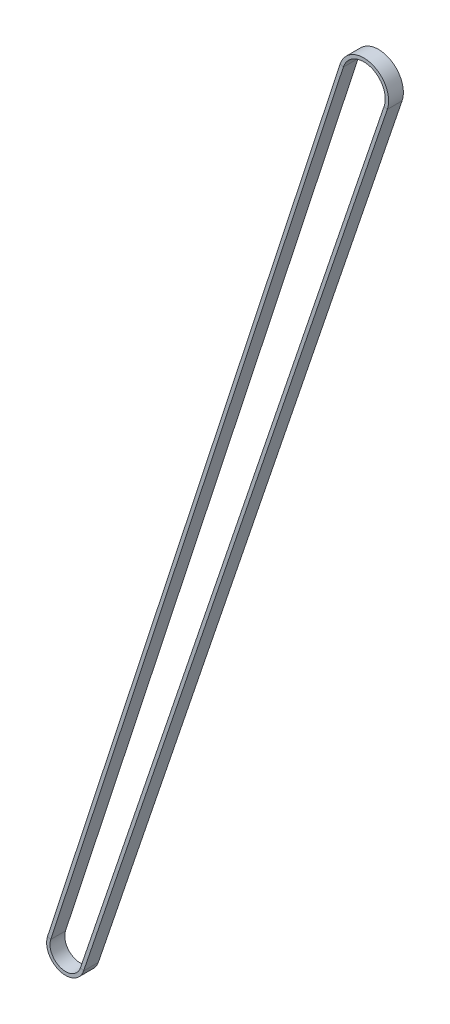
ISO-10303-21;
HEADER;
FILE_DESCRIPTION(('STEP AP214'),'2;1');
FILE_NAME('part.step','',(''),(''),'','','');
FILE_SCHEMA(('AUTOMOTIVE_DESIGN { 1 0 10303 214 1 1 1 1 }'));
ENDSEC;
DATA;
#1=APPLICATION_CONTEXT('core data for automotive mechanical design processes');
#2=APPLICATION_PROTOCOL_DEFINITION('international standard','automotive_design',2000,#1);
#3=PRODUCT_CONTEXT('',#1,'mechanical');
#4=PRODUCT('Part','Part','',(#3));
#5=PRODUCT_RELATED_PRODUCT_CATEGORY('part','',(#4));
#6=PRODUCT_DEFINITION_FORMATION('','',#4);
#7=PRODUCT_DEFINITION_CONTEXT('part definition',#1,'design');
#8=PRODUCT_DEFINITION('design','',#6,#7);
#9=PRODUCT_DEFINITION_SHAPE('','',#8);
#10=(LENGTH_UNIT() NAMED_UNIT(*) SI_UNIT(.MILLI.,.METRE.));
#11=(NAMED_UNIT(*) PLANE_ANGLE_UNIT() SI_UNIT($,.RADIAN.));
#12=(NAMED_UNIT(*) SI_UNIT($,.STERADIAN.) SOLID_ANGLE_UNIT());
#13=UNCERTAINTY_MEASURE_WITH_UNIT(LENGTH_MEASURE(1.E-05),#10,'distance_accuracy_value','');
#14=(GEOMETRIC_REPRESENTATION_CONTEXT(3) GLOBAL_UNCERTAINTY_ASSIGNED_CONTEXT((#13)) GLOBAL_UNIT_ASSIGNED_CONTEXT((#10,
#11,#12)) REPRESENTATION_CONTEXT('',''));
#15=CARTESIAN_POINT('',(0.,0.,0.));
#16=DIRECTION('',(0.,0.,1.));
#17=DIRECTION('',(1.,0.,0.));
#18=AXIS2_PLACEMENT_3D('',#15,#16,#17);
#19=CARTESIAN_POINT('',(121.383508925204,366.363412522024,0.));
#20=DIRECTION('',(0.,0.,1.));
#21=DIRECTION('',(1.,0.,0.));
#22=AXIS2_PLACEMENT_3D('',#19,#20,#21);
#23=CYLINDRICAL_SURFACE('',#22,8.75);
#24=DIRECTION('',(0.,0.,-1.));
#25=VECTOR('',#24,1.);
#26=CARTESIAN_POINT('',(129.672217688707,363.559877782836,2.99999999999995));
#27=LINE('',#26,#25);
#28=CARTESIAN_POINT('',(129.672217688707,363.559877782836,2.99999999999995));
#29=VERTEX_POINT('',#28);
#30=CARTESIAN_POINT('',(129.672217688707,363.559877782836,-3.00000000000006));
#31=VERTEX_POINT('',#30);
#32=EDGE_CURVE('E149',#29,#31,#27,.T.);
#33=ORIENTED_EDGE('',*,*,#32,.F.);
#34=CARTESIAN_POINT('',(121.383508925204,366.363412522024,2.99999999999995));
#35=DIRECTION('',(0.,0.,1.));
#36=DIRECTION('',(0.947281001543158,-0.320403970192932,0.));
#37=AXIS2_PLACEMENT_3D('',#34,#35,#36);
#38=CIRCLE('',#37,8.75);
#39=CARTESIAN_POINT('',(113.060574593496,369.063646606336,2.99999999999995));
#40=VERTEX_POINT('',#39);
#41=EDGE_CURVE('E148',#29,#40,#38,.T.);
#42=ORIENTED_EDGE('',*,*,#41,.T.);
#43=DIRECTION('',(0.,0.,-1.));
#44=VECTOR('',#43,1.);
#45=CARTESIAN_POINT('',(113.060574593496,369.063646606336,2.99999999999995));
#46=LINE('',#45,#44);
#47=CARTESIAN_POINT('',(113.060574593496,369.063646606336,-3.00000000000006));
#48=VERTEX_POINT('',#47);
#49=EDGE_CURVE('E127',#40,#48,#46,.T.);
#50=ORIENTED_EDGE('',*,*,#49,.T.);
#51=CARTESIAN_POINT('',(121.383508925204,366.363412522024,-3.00000000000006));
#52=DIRECTION('',(0.,0.,1.));
#53=DIRECTION('',(0.947281001543158,-0.320403970192932,0.));
#54=AXIS2_PLACEMENT_3D('',#51,#52,#53);
#55=CIRCLE('',#54,8.75);
#56=EDGE_CURVE('E153',#31,#48,#55,.T.);
#57=ORIENTED_EDGE('',*,*,#56,.F.);
#58=EDGE_LOOP('',(#33,#42,#50,#57));
#59=FACE_BOUND('',#58,.T.);
#60=ADVANCED_FACE('F33',(#59),#23,.F.);
#61=CARTESIAN_POINT('',(113.060574593496,369.063646606336,2.99999999999995));
#62=DIRECTION('',(-0.951192495052325,0.308598181064203,0.));
#63=DIRECTION('',(-0.308598181064203,-0.951192495052324,0.));
#64=AXIS2_PLACEMENT_3D('',#61,#62,#63);
#65=PLANE('',#64);
#66=DIRECTION('',(-0.308598181064203,-0.951192495052324,0.));
#67=VECTOR('',#66,1.);
#68=CARTESIAN_POINT('',(113.060574593496,369.063646606336,-3.00000000000006));
#69=LINE('',#68,#67);
#70=CARTESIAN_POINT('',(-6.04007234358223,1.95959844975768,-3.));
#71=VERTEX_POINT('',#70);
#72=EDGE_CURVE('E117',#48,#71,#69,.T.);
#73=ORIENTED_EDGE('',*,*,#72,.F.);
#74=ORIENTED_EDGE('',*,*,#49,.F.);
#75=DIRECTION('',(-0.308598181064203,-0.951192495052324,0.));
#76=VECTOR('',#75,1.);
#77=CARTESIAN_POINT('',(113.060574593496,369.063646606336,2.99999999999995));
#78=LINE('',#77,#76);
#79=CARTESIAN_POINT('',(-6.04007234358223,1.95959844975768,3.));
#80=VERTEX_POINT('',#79);
#81=EDGE_CURVE('E130',#40,#80,#78,.T.);
#82=ORIENTED_EDGE('',*,*,#81,.T.);
#83=DIRECTION('',(0.,0.,-1.));
#84=VECTOR('',#83,1.);
#85=CARTESIAN_POINT('',(-6.0400723435822,1.95959844975774,3.));
#86=LINE('',#85,#84);
#87=EDGE_CURVE('E145',#80,#71,#86,.T.);
#88=ORIENTED_EDGE('',*,*,#87,.T.);
#89=EDGE_LOOP('',(#73,#74,#82,#88));
#90=FACE_BOUND('',#89,.T.);
#91=ADVANCED_FACE('F129',(#90),#65,.F.);
#92=CARTESIAN_POINT('',(111.747928950324,369.489512096204,-3.00000000000006));
#93=DIRECTION('',(0.,0.,1.));
#94=DIRECTION('',(1.,0.,0.));
#95=AXIS2_PLACEMENT_3D('',#92,#93,#94);
#96=PLANE('',#95);
#97=DIRECTION('',(-0.308598181064203,-0.951192495052324,0.));
#98=VECTOR('',#97,1.);
#99=CARTESIAN_POINT('',(111.747928950324,369.489512096204,-3.00000000000006));
#100=LINE('',#99,#98);
#101=CARTESIAN_POINT('',(111.747928950324,369.489512096204,-3.00000000000006));
#102=VERTEX_POINT('',#101);
#103=CARTESIAN_POINT('',(-7.35271798675446,2.3854639396263,-3.));
#104=VERTEX_POINT('',#103);
#105=EDGE_CURVE('E111',#102,#104,#100,.T.);
#106=ORIENTED_EDGE('',*,*,#105,.F.);
#107=DIRECTION('',(-0.951192495052322,0.308598181064212,0.));
#108=VECTOR('',#107,1.);
#109=CARTESIAN_POINT('',(111.747928950324,369.489512096204,-3.00000000000006));
#110=LINE('',#109,#108);
#111=EDGE_CURVE('E135',#48,#102,#110,.T.);
#112=ORIENTED_EDGE('',*,*,#111,.F.);
#113=ORIENTED_EDGE('',*,*,#72,.T.);
#114=DIRECTION('',(-0.951192495052322,0.308598181064212,0.));
#115=VECTOR('',#114,1.);
#116=CARTESIAN_POINT('',(-7.35271798675441,2.38546393962635,-3.));
#117=LINE('',#116,#115);
#118=EDGE_CURVE('E200',#71,#104,#117,.T.);
#119=ORIENTED_EDGE('',*,*,#118,.T.);
#120=EDGE_LOOP('',(#106,#112,#113,#119));
#121=FACE_BOUND('',#120,.T.);
#122=ADVANCED_FACE('F216',(#121),#96,.F.);
#123=CARTESIAN_POINT('',(111.747928950324,369.489512096204,2.99999999999995));
#124=DIRECTION('',(0.951192495052325,-0.308598181064203,0.));
#125=DIRECTION('',(0.308598181064203,0.951192495052324,0.));
#126=AXIS2_PLACEMENT_3D('',#123,#124,#125);
#127=PLANE('',#126);
#128=DIRECTION('',(-0.308598181064203,-0.951192495052324,0.));
#129=VECTOR('',#128,1.);
#130=CARTESIAN_POINT('',(111.747928950324,369.489512096204,2.99999999999995));
#131=LINE('',#130,#129);
#132=CARTESIAN_POINT('',(111.747928950324,369.489512096204,2.99999999999995));
#133=VERTEX_POINT('',#132);
#134=CARTESIAN_POINT('',(-7.35271798675446,2.3854639396263,3.));
#135=VERTEX_POINT('',#134);
#136=EDGE_CURVE('E163',#133,#135,#131,.T.);
#137=ORIENTED_EDGE('',*,*,#136,.F.);
#138=DIRECTION('',(0.,0.,1.));
#139=VECTOR('',#138,1.);
#140=CARTESIAN_POINT('',(111.747928950324,369.489512096204,2.99999999999995));
#141=LINE('',#140,#139);
#142=EDGE_CURVE('E156',#102,#133,#141,.T.);
#143=ORIENTED_EDGE('',*,*,#142,.F.);
#144=ORIENTED_EDGE('',*,*,#105,.T.);
#145=DIRECTION('',(0.,0.,1.));
#146=VECTOR('',#145,1.);
#147=CARTESIAN_POINT('',(-7.35271798675441,2.38546393962635,3.));
#148=LINE('',#147,#146);
#149=EDGE_CURVE('E185',#104,#135,#148,.T.);
#150=ORIENTED_EDGE('',*,*,#149,.T.);
#151=EDGE_LOOP('',(#137,#143,#144,#150));
#152=FACE_BOUND('',#151,.T.);
#153=ADVANCED_FACE('F186',(#152),#127,.F.);
#154=CARTESIAN_POINT('',(111.747928950324,369.489512096204,2.99999999999995));
#155=DIRECTION('',(0.,0.,-1.));
#156=DIRECTION('',(-1.,0.,0.));
#157=AXIS2_PLACEMENT_3D('',#154,#155,#156);
#158=PLANE('',#157);
#159=DIRECTION('',(0.951192495052322,-0.308598181064212,0.));
#160=VECTOR('',#159,1.);
#161=CARTESIAN_POINT('',(-7.35271798675441,2.38546393962635,3.));
#162=LINE('',#161,#160);
#163=EDGE_CURVE('E143',#135,#80,#162,.T.);
#164=ORIENTED_EDGE('',*,*,#163,.T.);
#165=ORIENTED_EDGE('',*,*,#81,.F.);
#166=DIRECTION('',(0.951192495052322,-0.308598181064212,0.));
#167=VECTOR('',#166,1.);
#168=CARTESIAN_POINT('',(111.747928950324,369.489512096204,2.99999999999995));
#169=LINE('',#168,#167);
#170=EDGE_CURVE('E142',#133,#40,#169,.T.);
#171=ORIENTED_EDGE('',*,*,#170,.F.);
#172=ORIENTED_EDGE('',*,*,#136,.T.);
#173=EDGE_LOOP('',(#164,#165,#171,#172));
#174=FACE_BOUND('',#173,.T.);
#175=ADVANCED_FACE('F140',(#174),#158,.F.);
#176=CARTESIAN_POINT('',(0.,0.,0.));
#177=DIRECTION('',(0.,0.,1.));
#178=DIRECTION('',(1.,0.,0.));
#179=AXIS2_PLACEMENT_3D('',#176,#177,#178);
#180=CYLINDRICAL_SURFACE('',#179,6.34999999999991);
#181=CARTESIAN_POINT('',(0.,0.,-3.));
#182=DIRECTION('',(0.,0.,1.));
#183=DIRECTION('',(-0.951192495052326,0.308598181064198,0.));
#184=AXIS2_PLACEMENT_3D('',#181,#182,#183);
#185=CIRCLE('',#184,6.34999999999991);
#186=CARTESIAN_POINT('',(6.01523435979903,-2.03456521072501,-3.));
#187=VERTEX_POINT('',#186);
#188=EDGE_CURVE('E98',#71,#187,#185,.T.);
#189=ORIENTED_EDGE('',*,*,#188,.F.);
#190=ORIENTED_EDGE('',*,*,#87,.F.);
#191=CARTESIAN_POINT('',(0.,0.,3.));
#192=DIRECTION('',(0.,0.,1.));
#193=DIRECTION('',(-0.951192495052326,0.308598181064198,0.));
#194=AXIS2_PLACEMENT_3D('',#191,#192,#193);
#195=CIRCLE('',#194,6.34999999999991);
#196=CARTESIAN_POINT('',(6.01523435979903,-2.03456521072501,3.));
#197=VERTEX_POINT('',#196);
#198=EDGE_CURVE('E162',#80,#197,#195,.T.);
#199=ORIENTED_EDGE('',*,*,#198,.T.);
#200=DIRECTION('',(0.,0.,-1.));
#201=VECTOR('',#200,1.);
#202=CARTESIAN_POINT('',(6.0152343597991,-2.03456521072504,3.));
#203=LINE('',#202,#201);
#204=EDGE_CURVE('E191',#197,#187,#203,.T.);
#205=ORIENTED_EDGE('',*,*,#204,.T.);
#206=EDGE_LOOP('',(#189,#190,#199,#205));
#207=FACE_BOUND('',#206,.T.);
#208=ADVANCED_FACE('F215',(#207),#180,.F.);
#209=CARTESIAN_POINT('',(-7.35271798675435,2.3854639396263,-3.));
#210=DIRECTION('',(0.,0.,1.));
#211=DIRECTION('',(1.,0.,0.));
#212=AXIS2_PLACEMENT_3D('',#209,#210,#211);
#213=PLANE('',#212);
#214=CARTESIAN_POINT('',(0.,0.,-3.));
#215=DIRECTION('',(0.,0.,1.));
#216=DIRECTION('',(-0.951192495052325,0.3085981810642,0.));
#217=AXIS2_PLACEMENT_3D('',#214,#215,#216);
#218=CIRCLE('',#217,7.72999999999992);
#219=CARTESIAN_POINT('',(7.32248214192857,-2.47672268959129,-3.));
#220=VERTEX_POINT('',#219);
#221=EDGE_CURVE('E91',#104,#220,#218,.T.);
#222=ORIENTED_EDGE('',*,*,#221,.F.);
#223=ORIENTED_EDGE('',*,*,#118,.F.);
#224=ORIENTED_EDGE('',*,*,#188,.T.);
#225=DIRECTION('',(0.947281001543152,-0.320403970192947,0.));
#226=VECTOR('',#225,1.);
#227=CARTESIAN_POINT('',(7.32248214192865,-2.47672268959132,-3.));
#228=LINE('',#227,#226);
#229=EDGE_CURVE('E203',#187,#220,#228,.T.);
#230=ORIENTED_EDGE('',*,*,#229,.T.);
#231=EDGE_LOOP('',(#222,#223,#224,#230));
#232=FACE_BOUND('',#231,.T.);
#233=ADVANCED_FACE('F205',(#232),#213,.F.);
#234=CARTESIAN_POINT('',(0.,0.,0.));
#235=DIRECTION('',(0.,0.,1.));
#236=DIRECTION('',(1.,0.,0.));
#237=AXIS2_PLACEMENT_3D('',#234,#235,#236);
#238=CYLINDRICAL_SURFACE('',#237,7.72999999999992);
#239=CARTESIAN_POINT('',(0.,0.,3.));
#240=DIRECTION('',(0.,0.,1.));
#241=DIRECTION('',(-0.951192495052325,0.3085981810642,0.));
#242=AXIS2_PLACEMENT_3D('',#239,#240,#241);
#243=CIRCLE('',#242,7.72999999999992);
#244=CARTESIAN_POINT('',(7.32248214192857,-2.47672268959129,3.));
#245=VERTEX_POINT('',#244);
#246=EDGE_CURVE('E82',#135,#245,#243,.T.);
#247=ORIENTED_EDGE('',*,*,#246,.F.);
#248=ORIENTED_EDGE('',*,*,#149,.F.);
#249=ORIENTED_EDGE('',*,*,#221,.T.);
#250=DIRECTION('',(0.,0.,1.));
#251=VECTOR('',#250,1.);
#252=CARTESIAN_POINT('',(7.32248214192865,-2.47672268959132,3.));
#253=LINE('',#252,#251);
#254=EDGE_CURVE('E169',#220,#245,#253,.T.);
#255=ORIENTED_EDGE('',*,*,#254,.T.);
#256=EDGE_LOOP('',(#247,#248,#249,#255));
#257=FACE_BOUND('',#256,.T.);
#258=ADVANCED_FACE('F187',(#257),#238,.T.);
#259=CARTESIAN_POINT('',(-7.35271798675435,2.3854639396263,3.));
#260=DIRECTION('',(0.,0.,-1.));
#261=DIRECTION('',(-1.,0.,0.));
#262=AXIS2_PLACEMENT_3D('',#259,#260,#261);
#263=PLANE('',#262);
#264=DIRECTION('',(-0.947281001543152,0.320403970192947,0.));
#265=VECTOR('',#264,1.);
#266=CARTESIAN_POINT('',(7.32248214192865,-2.47672268959132,3.));
#267=LINE('',#266,#265);
#268=EDGE_CURVE('E164',#245,#197,#267,.T.);
#269=ORIENTED_EDGE('',*,*,#268,.T.);
#270=ORIENTED_EDGE('',*,*,#198,.F.);
#271=ORIENTED_EDGE('',*,*,#163,.F.);
#272=ORIENTED_EDGE('',*,*,#246,.T.);
#273=EDGE_LOOP('',(#269,#270,#271,#272));
#274=FACE_BOUND('',#273,.T.);
#275=ADVANCED_FACE('F188',(#274),#263,.F.);
#276=CARTESIAN_POINT('',(6.01523435979909,-2.03456521072504,3.));
#277=DIRECTION('',(0.947281001543155,-0.320403970192938,0.));
#278=DIRECTION('',(0.320403970192938,0.947281001543155,0.));
#279=AXIS2_PLACEMENT_3D('',#276,#277,#278);
#280=PLANE('',#279);
#281=DIRECTION('',(0.320403970192938,0.947281001543155,0.));
#282=VECTOR('',#281,1.);
#283=CARTESIAN_POINT('',(6.01523435979909,-2.03456521072504,-3.));
#284=LINE('',#283,#282);
#285=EDGE_CURVE('E167',#187,#31,#284,.T.);
#286=ORIENTED_EDGE('',*,*,#285,.F.);
#287=ORIENTED_EDGE('',*,*,#204,.F.);
#288=DIRECTION('',(0.320403970192938,0.947281001543155,0.));
#289=VECTOR('',#288,1.);
#290=CARTESIAN_POINT('',(6.01523435979909,-2.03456521072504,3.));
#291=LINE('',#290,#289);
#292=EDGE_CURVE('E165',#197,#29,#291,.T.);
#293=ORIENTED_EDGE('',*,*,#292,.T.);
#294=ORIENTED_EDGE('',*,*,#32,.T.);
#295=EDGE_LOOP('',(#286,#287,#293,#294));
#296=FACE_BOUND('',#295,.T.);
#297=ADVANCED_FACE('F214',(#296),#280,.F.);
#298=CARTESIAN_POINT('',(7.32248214192863,-2.47672268959137,-3.));
#299=DIRECTION('',(0.,0.,1.));
#300=DIRECTION('',(1.,0.,0.));
#301=AXIS2_PLACEMENT_3D('',#298,#299,#300);
#302=PLANE('',#301);
#303=DIRECTION('',(0.320403970192938,0.947281001543155,0.));
#304=VECTOR('',#303,1.);
#305=CARTESIAN_POINT('',(7.32248214192863,-2.47672268959137,-3.));
#306=LINE('',#305,#304);
#307=CARTESIAN_POINT('',(130.979465470836,363.117720303969,-3.00000000000006));
#308=VERTEX_POINT('',#307);
#309=EDGE_CURVE('E58',#220,#308,#306,.T.);
#310=ORIENTED_EDGE('',*,*,#309,.F.);
#311=ORIENTED_EDGE('',*,*,#229,.F.);
#312=ORIENTED_EDGE('',*,*,#285,.T.);
#313=DIRECTION('',(0.947281001543152,-0.320403970192947,0.));
#314=VECTOR('',#313,1.);
#315=CARTESIAN_POINT('',(130.979465470836,363.11772030397,-3.00000000000006));
#316=LINE('',#315,#314);
#317=EDGE_CURVE('E175',#31,#308,#316,.T.);
#318=ORIENTED_EDGE('',*,*,#317,.T.);
#319=EDGE_LOOP('',(#310,#311,#312,#318));
#320=FACE_BOUND('',#319,.T.);
#321=ADVANCED_FACE('F207',(#320),#302,.F.);
#322=CARTESIAN_POINT('',(7.32248214192863,-2.47672268959137,3.));
#323=DIRECTION('',(-0.947281001543155,0.320403970192938,0.));
#324=DIRECTION('',(-0.320403970192938,-0.947281001543155,0.));
#325=AXIS2_PLACEMENT_3D('',#322,#323,#324);
#326=PLANE('',#325);
#327=DIRECTION('',(0.320403970192938,0.947281001543155,0.));
#328=VECTOR('',#327,1.);
#329=CARTESIAN_POINT('',(7.32248214192863,-2.47672268959137,3.));
#330=LINE('',#329,#328);
#331=CARTESIAN_POINT('',(130.979465470836,363.117720303969,2.99999999999995));
#332=VERTEX_POINT('',#331);
#333=EDGE_CURVE('E50',#245,#332,#330,.T.);
#334=ORIENTED_EDGE('',*,*,#333,.F.);
#335=ORIENTED_EDGE('',*,*,#254,.F.);
#336=ORIENTED_EDGE('',*,*,#309,.T.);
#337=DIRECTION('',(0.,0.,1.));
#338=VECTOR('',#337,1.);
#339=CARTESIAN_POINT('',(130.979465470836,363.11772030397,2.99999999999995));
#340=LINE('',#339,#338);
#341=EDGE_CURVE('E174',#308,#332,#340,.T.);
#342=ORIENTED_EDGE('',*,*,#341,.T.);
#343=EDGE_LOOP('',(#334,#335,#336,#342));
#344=FACE_BOUND('',#343,.T.);
#345=ADVANCED_FACE('F210',(#344),#326,.F.);
#346=CARTESIAN_POINT('',(7.32248214192863,-2.47672268959137,3.));
#347=DIRECTION('',(0.,0.,-1.));
#348=DIRECTION('',(-1.,0.,0.));
#349=AXIS2_PLACEMENT_3D('',#346,#347,#348);
#350=PLANE('',#349);
#351=DIRECTION('',(-0.947281001543152,0.320403970192947,0.));
#352=VECTOR('',#351,1.);
#353=CARTESIAN_POINT('',(130.979465470836,363.11772030397,2.99999999999995));
#354=LINE('',#353,#352);
#355=EDGE_CURVE('E37',#332,#29,#354,.T.);
#356=ORIENTED_EDGE('',*,*,#355,.T.);
#357=ORIENTED_EDGE('',*,*,#292,.F.);
#358=ORIENTED_EDGE('',*,*,#268,.F.);
#359=ORIENTED_EDGE('',*,*,#333,.T.);
#360=EDGE_LOOP('',(#356,#357,#358,#359));
#361=FACE_BOUND('',#360,.T.);
#362=ADVANCED_FACE('F211',(#361),#350,.F.);
#363=CARTESIAN_POINT('',(130.979465470836,363.11772030397,-3.00000000000006));
#364=DIRECTION('',(0.,0.,1.));
#365=DIRECTION('',(1.,0.,0.));
#366=AXIS2_PLACEMENT_3D('',#363,#364,#365);
#367=PLANE('',#366);
#368=ORIENTED_EDGE('',*,*,#56,.T.);
#369=ORIENTED_EDGE('',*,*,#111,.T.);
#370=CARTESIAN_POINT('',(121.383508925204,366.363412522024,-3.00000000000006));
#371=DIRECTION('',(0.,0.,1.));
#372=DIRECTION('',(0.947281001543156,-0.320403970192935,0.));
#373=AXIS2_PLACEMENT_3D('',#370,#371,#372);
#374=CIRCLE('',#373,10.13);
#375=EDGE_CURVE('E42',#308,#102,#374,.T.);
#376=ORIENTED_EDGE('',*,*,#375,.F.);
#377=ORIENTED_EDGE('',*,*,#317,.F.);
#378=EDGE_LOOP('',(#368,#369,#376,#377));
#379=FACE_BOUND('',#378,.T.);
#380=ADVANCED_FACE('F219',(#379),#367,.F.);
#381=CARTESIAN_POINT('',(121.383508925204,366.363412522024,0.));
#382=DIRECTION('',(0.,0.,1.));
#383=DIRECTION('',(1.,0.,0.));
#384=AXIS2_PLACEMENT_3D('',#381,#382,#383);
#385=CYLINDRICAL_SURFACE('',#384,10.13);
#386=ORIENTED_EDGE('',*,*,#375,.T.);
#387=ORIENTED_EDGE('',*,*,#142,.T.);
#388=CARTESIAN_POINT('',(121.383508925204,366.363412522024,2.99999999999995));
#389=DIRECTION('',(0.,0.,1.));
#390=DIRECTION('',(0.947281001543156,-0.320403970192935,0.));
#391=AXIS2_PLACEMENT_3D('',#388,#389,#390);
#392=CIRCLE('',#391,10.13);
#393=EDGE_CURVE('E11',#332,#133,#392,.T.);
#394=ORIENTED_EDGE('',*,*,#393,.F.);
#395=ORIENTED_EDGE('',*,*,#341,.F.);
#396=EDGE_LOOP('',(#386,#387,#394,#395));
#397=FACE_BOUND('',#396,.T.);
#398=ADVANCED_FACE('F221',(#397),#385,.T.);
#399=CARTESIAN_POINT('',(130.979465470836,363.11772030397,2.99999999999995));
#400=DIRECTION('',(0.,0.,-1.));
#401=DIRECTION('',(-1.,0.,0.));
#402=AXIS2_PLACEMENT_3D('',#399,#400,#401);
#403=PLANE('',#402);
#404=ORIENTED_EDGE('',*,*,#393,.T.);
#405=ORIENTED_EDGE('',*,*,#170,.T.);
#406=ORIENTED_EDGE('',*,*,#41,.F.);
#407=ORIENTED_EDGE('',*,*,#355,.F.);
#408=EDGE_LOOP('',(#404,#405,#406,#407));
#409=FACE_BOUND('',#408,.T.);
#410=ADVANCED_FACE('F35',(#409),#403,.F.);
#411=CLOSED_SHELL('',(#60,#91,#122,#153,#175,#208,#233,#258,#275,#297,#321,#345,#362,#380,#398,#410));
#412=MANIFOLD_SOLID_BREP('B2',#411);
#413=ADVANCED_BREP_SHAPE_REPRESENTATION('',(#18,#412),#14);
#414=SHAPE_DEFINITION_REPRESENTATION(#9,#413);
ENDSEC;
END-ISO-10303-21;
